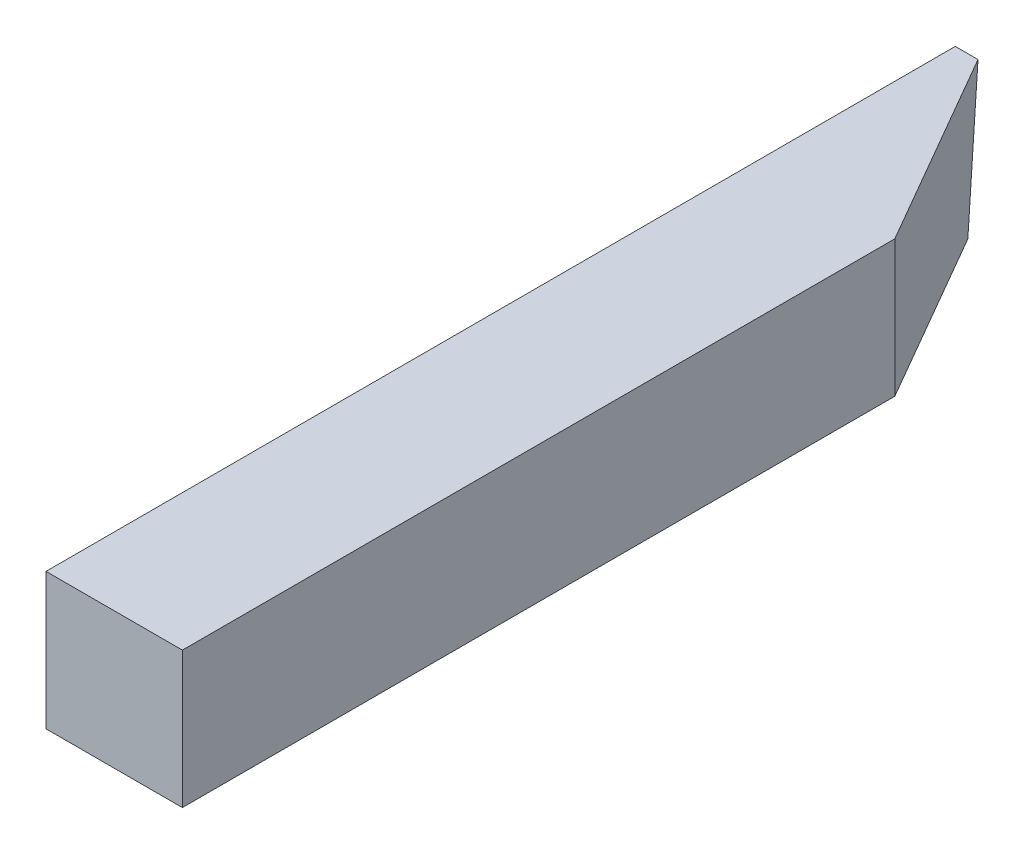
ISO-10303-21;
HEADER;
FILE_DESCRIPTION(('STEP AP214'),'2;1');
FILE_NAME('part.step','',(''),(''),'','','');
FILE_SCHEMA(('AUTOMOTIVE_DESIGN { 1 0 10303 214 1 1 1 1 }'));
ENDSEC;
DATA;
#1=APPLICATION_CONTEXT('core data for automotive mechanical design processes');
#2=APPLICATION_PROTOCOL_DEFINITION('international standard','automotive_design',2000,#1);
#3=PRODUCT_CONTEXT('',#1,'mechanical');
#4=PRODUCT('Part','Part','',(#3));
#5=PRODUCT_RELATED_PRODUCT_CATEGORY('part','',(#4));
#6=PRODUCT_DEFINITION_FORMATION('','',#4);
#7=PRODUCT_DEFINITION_CONTEXT('part definition',#1,'design');
#8=PRODUCT_DEFINITION('design','',#6,#7);
#9=PRODUCT_DEFINITION_SHAPE('','',#8);
#10=(LENGTH_UNIT() NAMED_UNIT(*) SI_UNIT(.MILLI.,.METRE.));
#11=(NAMED_UNIT(*) PLANE_ANGLE_UNIT() SI_UNIT($,.RADIAN.));
#12=(NAMED_UNIT(*) SI_UNIT($,.STERADIAN.) SOLID_ANGLE_UNIT());
#13=UNCERTAINTY_MEASURE_WITH_UNIT(LENGTH_MEASURE(1.E-05),#10,'distance_accuracy_value','');
#14=(GEOMETRIC_REPRESENTATION_CONTEXT(3) GLOBAL_UNCERTAINTY_ASSIGNED_CONTEXT((#13)) GLOBAL_UNIT_ASSIGNED_CONTEXT((#10,
#11,#12)) REPRESENTATION_CONTEXT('',''));
#15=CARTESIAN_POINT('',(0.,0.,0.));
#16=DIRECTION('',(0.,0.,1.));
#17=DIRECTION('',(1.,0.,0.));
#18=AXIS2_PLACEMENT_3D('',#15,#16,#17);
#19=CARTESIAN_POINT('',(-9.525,9.525,0.));
#20=DIRECTION('',(0.,0.,-1.));
#21=DIRECTION('',(-1.,0.,0.));
#22=AXIS2_PLACEMENT_3D('',#19,#20,#21);
#23=PLANE('',#22);
#24=DIRECTION('',(1.,0.,0.));
#25=VECTOR('',#24,1.);
#26=CARTESIAN_POINT('',(-9.525,0.,0.));
#27=LINE('',#26,#25);
#28=CARTESIAN_POINT('',(-9.525,0.,0.));
#29=VERTEX_POINT('',#28);
#30=CARTESIAN_POINT('',(0.,0.,0.));
#31=VERTEX_POINT('',#30);
#32=EDGE_CURVE('E102',#29,#31,#27,.T.);
#33=ORIENTED_EDGE('',*,*,#32,.T.);
#34=DIRECTION('',(0.,-1.,0.));
#35=VECTOR('',#34,1.);
#36=CARTESIAN_POINT('',(0.,9.525,0.));
#37=LINE('',#36,#35);
#38=CARTESIAN_POINT('',(0.,9.525,0.));
#39=VERTEX_POINT('',#38);
#40=EDGE_CURVE('E11',#39,#31,#37,.T.);
#41=ORIENTED_EDGE('',*,*,#40,.F.);
#42=DIRECTION('',(1.,0.,0.));
#43=VECTOR('',#42,1.);
#44=CARTESIAN_POINT('',(-9.525,9.525,0.));
#45=LINE('',#44,#43);
#46=CARTESIAN_POINT('',(-9.525,9.525,0.));
#47=VERTEX_POINT('',#46);
#48=EDGE_CURVE('E110',#47,#39,#45,.T.);
#49=ORIENTED_EDGE('',*,*,#48,.F.);
#50=DIRECTION('',(0.,-1.,0.));
#51=VECTOR('',#50,1.);
#52=CARTESIAN_POINT('',(-9.525,9.525,0.));
#53=LINE('',#52,#51);
#54=EDGE_CURVE('E96',#47,#29,#53,.T.);
#55=ORIENTED_EDGE('',*,*,#54,.T.);
#56=EDGE_LOOP('',(#33,#41,#49,#55));
#57=FACE_BOUND('',#56,.T.);
#58=ADVANCED_FACE('F32',(#57),#23,.F.);
#59=CARTESIAN_POINT('',(0.,9.525,0.));
#60=DIRECTION('',(-1.,0.,0.));
#61=DIRECTION('',(0.,0.,1.));
#62=AXIS2_PLACEMENT_3D('',#59,#60,#61);
#63=PLANE('',#62);
#64=DIRECTION('',(0.,0.,-1.));
#65=VECTOR('',#64,1.);
#66=CARTESIAN_POINT('',(0.,0.,0.));
#67=LINE('',#66,#65);
#68=CARTESIAN_POINT('',(0.,0.,-49.751846714922));
#69=VERTEX_POINT('',#68);
#70=EDGE_CURVE('E105',#31,#69,#67,.T.);
#71=ORIENTED_EDGE('',*,*,#70,.T.);
#72=DIRECTION('',(0.,-1.,0.));
#73=VECTOR('',#72,1.);
#74=CARTESIAN_POINT('',(0.,9.525,-49.751846714922));
#75=LINE('',#74,#73);
#76=CARTESIAN_POINT('',(0.,9.525,-49.751846714922));
#77=VERTEX_POINT('',#76);
#78=EDGE_CURVE('E39',#77,#69,#75,.T.);
#79=ORIENTED_EDGE('',*,*,#78,.F.);
#80=DIRECTION('',(0.,0.,-1.));
#81=VECTOR('',#80,1.);
#82=CARTESIAN_POINT('',(0.,9.525,0.));
#83=LINE('',#82,#81);
#84=EDGE_CURVE('E78',#39,#77,#83,.T.);
#85=ORIENTED_EDGE('',*,*,#84,.F.);
#86=ORIENTED_EDGE('',*,*,#40,.T.);
#87=EDGE_LOOP('',(#71,#79,#85,#86));
#88=FACE_BOUND('',#87,.T.);
#89=ADVANCED_FACE('F124',(#88),#63,.F.);
#90=CARTESIAN_POINT('',(0.,9.525,-49.751846714922));
#91=DIRECTION('',(-0.86602540378444,0.,0.499999999999998));
#92=DIRECTION('',(0.499999999999998,0.,0.86602540378444));
#93=AXIS2_PLACEMENT_3D('',#90,#91,#92);
#94=PLANE('',#93);
#95=DIRECTION('',(-0.499999999999998,0.,-0.86602540378444));
#96=VECTOR('',#95,1.);
#97=CARTESIAN_POINT('',(0.,0.,-49.751846714922));
#98=LINE('',#97,#96);
#99=CARTESIAN_POINT('',(-6.96783185637005,0.,-61.8204855087519));
#100=VERTEX_POINT('',#99);
#101=EDGE_CURVE('E107',#69,#100,#98,.T.);
#102=ORIENTED_EDGE('',*,*,#101,.T.);
#103=DIRECTION('',(-0.0997557416394283,0.979895488325092,-0.172782012866205));
#104=VECTOR('',#103,1.);
#105=CARTESIAN_POINT('',(-7.62154914631648,6.42143111294775,-62.9527570687254));
#106=LINE('',#105,#104);
#107=CARTESIAN_POINT('',(-7.9375,9.525,-63.5));
#108=VERTEX_POINT('',#107);
#109=EDGE_CURVE('E46',#100,#108,#106,.T.);
#110=ORIENTED_EDGE('',*,*,#109,.T.);
#111=DIRECTION('',(-0.499999999999998,0.,-0.86602540378444));
#112=VECTOR('',#111,1.);
#113=CARTESIAN_POINT('',(0.,9.525,-49.751846714922));
#114=LINE('',#113,#112);
#115=EDGE_CURVE('E93',#77,#108,#114,.T.);
#116=ORIENTED_EDGE('',*,*,#115,.F.);
#117=ORIENTED_EDGE('',*,*,#78,.T.);
#118=EDGE_LOOP('',(#102,#110,#116,#117));
#119=FACE_BOUND('',#118,.T.);
#120=ADVANCED_FACE('F114',(#119),#94,.F.);
#121=CARTESIAN_POINT('',(-9.52500000000001,9.525,-63.5));
#122=DIRECTION('',(1.,0.,0.));
#123=DIRECTION('',(0.,0.,-1.));
#124=AXIS2_PLACEMENT_3D('',#121,#122,#123);
#125=PLANE('',#124);
#126=DIRECTION('',(0.,0.,1.));
#127=VECTOR('',#126,1.);
#128=CARTESIAN_POINT('',(-9.52500000000001,9.525,-63.5));
#129=LINE('',#128,#127);
#130=CARTESIAN_POINT('',(-9.525,9.525,-63.5));
#131=VERTEX_POINT('',#130);
#132=EDGE_CURVE('E55',#131,#47,#129,.T.);
#133=ORIENTED_EDGE('',*,*,#132,.F.);
#134=DIRECTION('',(0.,-0.984807753012209,0.173648177666925));
#135=VECTOR('',#134,1.);
#136=CARTESIAN_POINT('',(-9.525,9.525,-63.5));
#137=LINE('',#136,#135);
#138=CARTESIAN_POINT('',(-9.525,0.,-61.8204855087519));
#139=VERTEX_POINT('',#138);
#140=EDGE_CURVE('E85',#131,#139,#137,.T.);
#141=ORIENTED_EDGE('',*,*,#140,.T.);
#142=DIRECTION('',(0.,0.,1.));
#143=VECTOR('',#142,1.);
#144=CARTESIAN_POINT('',(-9.52500000000001,0.,-63.5));
#145=LINE('',#144,#143);
#146=EDGE_CURVE('E73',#139,#29,#145,.T.);
#147=ORIENTED_EDGE('',*,*,#146,.T.);
#148=ORIENTED_EDGE('',*,*,#54,.F.);
#149=EDGE_LOOP('',(#133,#141,#147,#148));
#150=FACE_BOUND('',#149,.T.);
#151=ADVANCED_FACE('F95',(#150),#125,.F.);
#152=CARTESIAN_POINT('',(0.,9.525,0.));
#153=DIRECTION('',(0.,1.,0.));
#154=DIRECTION('',(0.,0.,1.));
#155=AXIS2_PLACEMENT_3D('',#152,#153,#154);
#156=PLANE('',#155);
#157=ORIENTED_EDGE('',*,*,#48,.T.);
#158=ORIENTED_EDGE('',*,*,#84,.T.);
#159=ORIENTED_EDGE('',*,*,#115,.T.);
#160=DIRECTION('',(-1.,0.,0.));
#161=VECTOR('',#160,1.);
#162=CARTESIAN_POINT('',(-7.93750000000001,9.525,-63.5));
#163=LINE('',#162,#161);
#164=EDGE_CURVE('E87',#108,#131,#163,.T.);
#165=ORIENTED_EDGE('',*,*,#164,.T.);
#166=ORIENTED_EDGE('',*,*,#132,.T.);
#167=EDGE_LOOP('',(#157,#158,#159,#165,#166));
#168=FACE_BOUND('',#167,.T.);
#169=ADVANCED_FACE('F91',(#168),#156,.T.);
#170=CARTESIAN_POINT('',(0.,0.,0.));
#171=DIRECTION('',(0.,1.,0.));
#172=DIRECTION('',(0.,0.,1.));
#173=AXIS2_PLACEMENT_3D('',#170,#171,#172);
#174=PLANE('',#173);
#175=ORIENTED_EDGE('',*,*,#146,.F.);
#176=DIRECTION('',(1.,0.,0.));
#177=VECTOR('',#176,1.);
#178=CARTESIAN_POINT('',(-9.525,0.,-61.8204855087519));
#179=LINE('',#178,#177);
#180=EDGE_CURVE('E88',#139,#100,#179,.T.);
#181=ORIENTED_EDGE('',*,*,#180,.T.);
#182=ORIENTED_EDGE('',*,*,#101,.F.);
#183=ORIENTED_EDGE('',*,*,#70,.F.);
#184=ORIENTED_EDGE('',*,*,#32,.F.);
#185=EDGE_LOOP('',(#175,#181,#182,#183,#184));
#186=FACE_BOUND('',#185,.T.);
#187=ADVANCED_FACE('F116',(#186),#174,.F.);
#188=CARTESIAN_POINT('',(-9.525,9.525,-63.5));
#189=DIRECTION('',(0.,0.173648177666925,0.984807753012209));
#190=DIRECTION('',(0.,-0.984807753012209,0.173648177666925));
#191=AXIS2_PLACEMENT_3D('',#188,#189,#190);
#192=PLANE('',#191);
#193=ORIENTED_EDGE('',*,*,#180,.F.);
#194=ORIENTED_EDGE('',*,*,#140,.F.);
#195=ORIENTED_EDGE('',*,*,#164,.F.);
#196=ORIENTED_EDGE('',*,*,#109,.F.);
#197=EDGE_LOOP('',(#193,#194,#195,#196));
#198=FACE_BOUND('',#197,.T.);
#199=ADVANCED_FACE('F86',(#198),#192,.F.);
#200=CLOSED_SHELL('',(#58,#89,#120,#151,#169,#187,#199));
#201=MANIFOLD_SOLID_BREP('B2',#200);
#202=ADVANCED_BREP_SHAPE_REPRESENTATION('',(#18,#201),#14);
#203=SHAPE_DEFINITION_REPRESENTATION(#9,#202);
ENDSEC;
END-ISO-10303-21;
